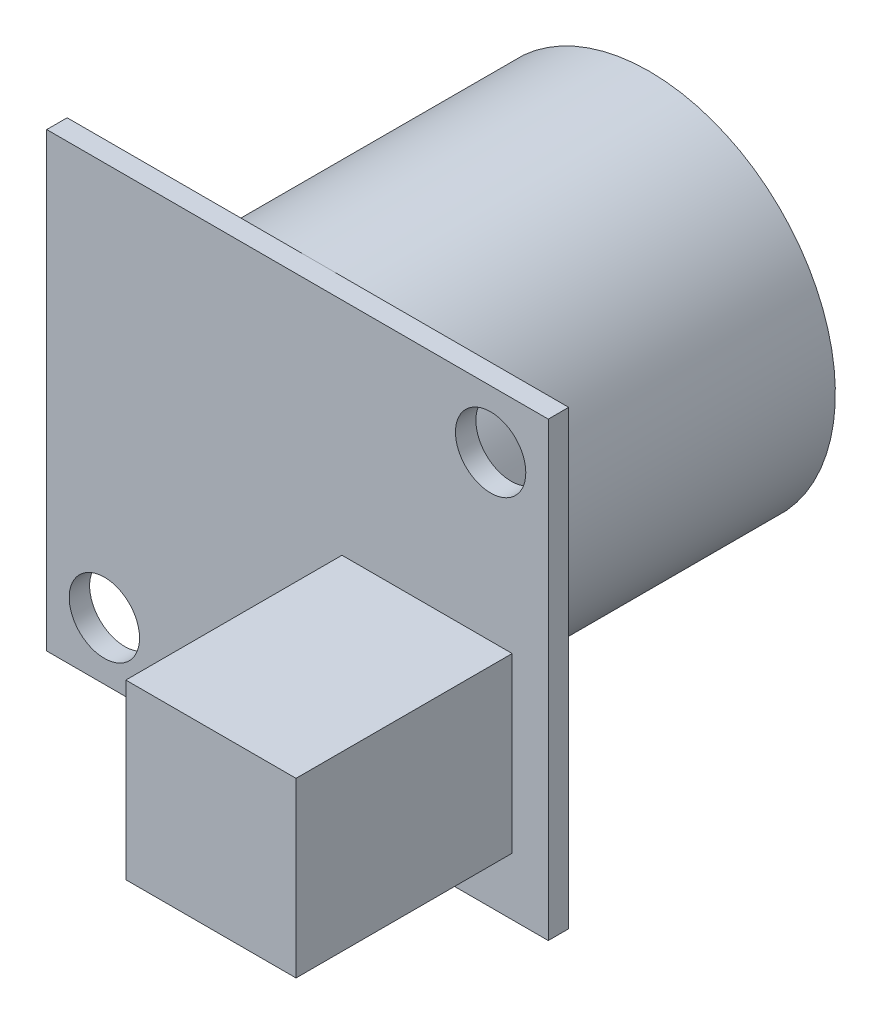
ISO-10303-21;
HEADER;
FILE_DESCRIPTION(('STEP AP214'),'2;1');
FILE_NAME('part.step','',(''),(''),'','','');
FILE_SCHEMA(('AUTOMOTIVE_DESIGN { 1 0 10303 214 1 1 1 1 }'));
ENDSEC;
DATA;
#1=APPLICATION_CONTEXT('core data for automotive mechanical design processes');
#2=APPLICATION_PROTOCOL_DEFINITION('international standard','automotive_design',2000,#1);
#3=PRODUCT_CONTEXT('',#1,'mechanical');
#4=PRODUCT('Part','Part','',(#3));
#5=PRODUCT_RELATED_PRODUCT_CATEGORY('part','',(#4));
#6=PRODUCT_DEFINITION_FORMATION('','',#4);
#7=PRODUCT_DEFINITION_CONTEXT('part definition',#1,'design');
#8=PRODUCT_DEFINITION('design','',#6,#7);
#9=PRODUCT_DEFINITION_SHAPE('','',#8);
#10=(LENGTH_UNIT() NAMED_UNIT(*) SI_UNIT(.MILLI.,.METRE.));
#11=(NAMED_UNIT(*) PLANE_ANGLE_UNIT() SI_UNIT($,.RADIAN.));
#12=(NAMED_UNIT(*) SI_UNIT($,.STERADIAN.) SOLID_ANGLE_UNIT());
#13=UNCERTAINTY_MEASURE_WITH_UNIT(LENGTH_MEASURE(1.E-05),#10,'distance_accuracy_value','');
#14=(GEOMETRIC_REPRESENTATION_CONTEXT(3) GLOBAL_UNCERTAINTY_ASSIGNED_CONTEXT((#13)) GLOBAL_UNIT_ASSIGNED_CONTEXT((#10,
#11,#12)) REPRESENTATION_CONTEXT('',''));
#15=CARTESIAN_POINT('',(0.,0.,0.));
#16=DIRECTION('',(0.,0.,1.));
#17=DIRECTION('',(1.,0.,0.));
#18=AXIS2_PLACEMENT_3D('',#15,#16,#17);
#19=CARTESIAN_POINT('',(0.,0.,0.9));
#20=DIRECTION('',(0.,0.,1.));
#21=DIRECTION('',(1.,0.,0.));
#22=AXIS2_PLACEMENT_3D('',#19,#20,#21);
#23=PLANE('',#22);
#24=CARTESIAN_POINT('',(8.51000000000001,7.41,0.9));
#25=DIRECTION('',(0.,0.,1.));
#26=DIRECTION('',(1.,0.,0.));
#27=AXIS2_PLACEMENT_3D('',#24,#25,#26);
#28=CIRCLE('',#27,1.55);
#29=CARTESIAN_POINT('',(10.06,7.41,0.9));
#30=VERTEX_POINT('',#29);
#31=EDGE_CURVE('E179',#30,#30,#28,.T.);
#32=ORIENTED_EDGE('',*,*,#31,.F.);
#33=EDGE_LOOP('',(#32));
#34=FACE_BOUND('',#33,.T.);
#35=DIRECTION('',(1.,0.,0.));
#36=VECTOR('',#35,1.);
#37=CARTESIAN_POINT('',(-11.05,-9.95,0.9));
#38=LINE('',#37,#36);
#39=CARTESIAN_POINT('',(-11.05,-9.95,0.9));
#40=VERTEX_POINT('',#39);
#41=CARTESIAN_POINT('',(11.05,-9.95,0.9));
#42=VERTEX_POINT('',#41);
#43=EDGE_CURVE('E165',#40,#42,#38,.T.);
#44=ORIENTED_EDGE('',*,*,#43,.T.);
#45=DIRECTION('',(0.,1.,0.));
#46=VECTOR('',#45,1.);
#47=CARTESIAN_POINT('',(11.05,-9.95,0.9));
#48=LINE('',#47,#46);
#49=CARTESIAN_POINT('',(11.05,9.95,0.9));
#50=VERTEX_POINT('',#49);
#51=EDGE_CURVE('E117',#42,#50,#48,.T.);
#52=ORIENTED_EDGE('',*,*,#51,.T.);
#53=DIRECTION('',(1.,0.,0.));
#54=VECTOR('',#53,1.);
#55=CARTESIAN_POINT('',(-11.05,9.95,0.9));
#56=LINE('',#55,#54);
#57=CARTESIAN_POINT('',(-11.05,9.95,0.9));
#58=VERTEX_POINT('',#57);
#59=EDGE_CURVE('E172',#58,#50,#56,.T.);
#60=ORIENTED_EDGE('',*,*,#59,.F.);
#61=DIRECTION('',(0.,1.,0.));
#62=VECTOR('',#61,1.);
#63=CARTESIAN_POINT('',(-11.05,-9.95,0.9));
#64=LINE('',#63,#62);
#65=EDGE_CURVE('E168',#40,#58,#64,.T.);
#66=ORIENTED_EDGE('',*,*,#65,.F.);
#67=EDGE_LOOP('',(#44,#52,#60,#66));
#68=FACE_BOUND('',#67,.T.);
#69=CARTESIAN_POINT('',(-8.50999999999999,-7.41,0.9));
#70=DIRECTION('',(0.,0.,1.));
#71=DIRECTION('',(1.,0.,0.));
#72=AXIS2_PLACEMENT_3D('',#69,#70,#71);
#73=CIRCLE('',#72,1.55);
#74=CARTESIAN_POINT('',(-6.96,-7.41,0.9));
#75=VERTEX_POINT('',#74);
#76=EDGE_CURVE('E187',#75,#75,#73,.T.);
#77=ORIENTED_EDGE('',*,*,#76,.F.);
#78=EDGE_LOOP('',(#77));
#79=FACE_BOUND('',#78,.T.);
#80=DIRECTION('',(1.,0.,0.));
#81=VECTOR('',#80,1.);
#82=CARTESIAN_POINT('',(1.96017418056904,-7.41,0.9));
#83=LINE('',#82,#81);
#84=CARTESIAN_POINT('',(1.96017418056904,-7.41,0.9));
#85=VERTEX_POINT('',#84);
#86=CARTESIAN_POINT('',(9.46017418056904,-7.41,0.9));
#87=VERTEX_POINT('',#86);
#88=EDGE_CURVE('E246',#85,#87,#83,.T.);
#89=ORIENTED_EDGE('',*,*,#88,.F.);
#90=DIRECTION('',(0.,-1.,0.));
#91=VECTOR('',#90,1.);
#92=CARTESIAN_POINT('',(1.96017418056904,0.210000000000003,0.9));
#93=LINE('',#92,#91);
#94=CARTESIAN_POINT('',(1.96017418056904,0.210000000000003,0.9));
#95=VERTEX_POINT('',#94);
#96=EDGE_CURVE('E248',#95,#85,#93,.T.);
#97=ORIENTED_EDGE('',*,*,#96,.F.);
#98=DIRECTION('',(-1.,0.,0.));
#99=VECTOR('',#98,1.);
#100=CARTESIAN_POINT('',(1.96017418056904,0.210000000000003,0.9));
#101=LINE('',#100,#99);
#102=CARTESIAN_POINT('',(9.46017418056904,0.210000000000003,0.9));
#103=VERTEX_POINT('',#102);
#104=EDGE_CURVE('E241',#103,#95,#101,.T.);
#105=ORIENTED_EDGE('',*,*,#104,.F.);
#106=DIRECTION('',(0.,1.,0.));
#107=VECTOR('',#106,1.);
#108=CARTESIAN_POINT('',(9.46017418056904,0.210000000000003,0.9));
#109=LINE('',#108,#107);
#110=EDGE_CURVE('E244',#87,#103,#109,.T.);
#111=ORIENTED_EDGE('',*,*,#110,.F.);
#112=EDGE_LOOP('',(#89,#97,#105,#111));
#113=FACE_BOUND('',#112,.T.);
#114=ADVANCED_FACE('F67',(#34,#68,#79,#113),#23,.T.);
#115=CARTESIAN_POINT('',(0.,0.,0.));
#116=DIRECTION('',(0.,0.,1.));
#117=DIRECTION('',(1.,0.,0.));
#118=AXIS2_PLACEMENT_3D('',#115,#116,#117);
#119=PLANE('',#118);
#120=DIRECTION('',(1.,0.,0.));
#121=VECTOR('',#120,1.);
#122=CARTESIAN_POINT('',(-11.05,9.95,0.));
#123=LINE('',#122,#121);
#124=CARTESIAN_POINT('',(-11.05,9.95,0.));
#125=VERTEX_POINT('',#124);
#126=CARTESIAN_POINT('',(0.,9.95,0.));
#127=VERTEX_POINT('',#126);
#128=EDGE_CURVE('E145',#125,#127,#123,.T.);
#129=ORIENTED_EDGE('',*,*,#128,.T.);
#130=CARTESIAN_POINT('',(0.,1.75,0.));
#131=DIRECTION('',(0.,0.,-1.));
#132=DIRECTION('',(-1.,0.,0.));
#133=AXIS2_PLACEMENT_3D('',#130,#131,#132);
#134=CIRCLE('',#133,8.2);
#135=EDGE_CURVE('E150',#127,#127,#134,.T.);
#136=ORIENTED_EDGE('',*,*,#135,.F.);
#137=CARTESIAN_POINT('',(11.05,9.95,0.));
#138=VERTEX_POINT('',#137);
#139=EDGE_CURVE('E153',#127,#138,#123,.T.);
#140=ORIENTED_EDGE('',*,*,#139,.T.);
#141=DIRECTION('',(0.,1.,0.));
#142=VECTOR('',#141,1.);
#143=CARTESIAN_POINT('',(11.05,-9.95,0.));
#144=LINE('',#143,#142);
#145=CARTESIAN_POINT('',(11.05,-9.95,0.));
#146=VERTEX_POINT('',#145);
#147=EDGE_CURVE('E159',#146,#138,#144,.T.);
#148=ORIENTED_EDGE('',*,*,#147,.F.);
#149=DIRECTION('',(1.,0.,0.));
#150=VECTOR('',#149,1.);
#151=CARTESIAN_POINT('',(-11.05,-9.95,0.));
#152=LINE('',#151,#150);
#153=CARTESIAN_POINT('',(-11.05,-9.95,0.));
#154=VERTEX_POINT('',#153);
#155=EDGE_CURVE('E160',#154,#146,#152,.T.);
#156=ORIENTED_EDGE('',*,*,#155,.F.);
#157=DIRECTION('',(0.,1.,0.));
#158=VECTOR('',#157,1.);
#159=CARTESIAN_POINT('',(-11.05,-9.95,0.));
#160=LINE('',#159,#158);
#161=EDGE_CURVE('E151',#154,#125,#160,.T.);
#162=ORIENTED_EDGE('',*,*,#161,.T.);
#163=EDGE_LOOP('',(#129,#136,#140,#148,#156,#162));
#164=FACE_BOUND('',#163,.T.);
#165=CARTESIAN_POINT('',(8.51000000000001,7.41,0.));
#166=DIRECTION('',(0.,0.,1.));
#167=DIRECTION('',(1.,0.,0.));
#168=AXIS2_PLACEMENT_3D('',#165,#166,#167);
#169=CIRCLE('',#168,1.55);
#170=CARTESIAN_POINT('',(10.06,7.41,0.));
#171=VERTEX_POINT('',#170);
#172=EDGE_CURVE('E182',#171,#171,#169,.T.);
#173=ORIENTED_EDGE('',*,*,#172,.T.);
#174=EDGE_LOOP('',(#173));
#175=FACE_BOUND('',#174,.T.);
#176=CARTESIAN_POINT('',(-8.50999999999999,-7.41,0.));
#177=DIRECTION('',(0.,0.,1.));
#178=DIRECTION('',(1.,0.,0.));
#179=AXIS2_PLACEMENT_3D('',#176,#177,#178);
#180=CIRCLE('',#179,1.55);
#181=CARTESIAN_POINT('',(-6.96,-7.41,0.));
#182=VERTEX_POINT('',#181);
#183=EDGE_CURVE('E190',#182,#182,#180,.T.);
#184=ORIENTED_EDGE('',*,*,#183,.T.);
#185=EDGE_LOOP('',(#184));
#186=FACE_BOUND('',#185,.T.);
#187=ADVANCED_FACE('F147',(#164,#175,#186),#119,.F.);
#188=CARTESIAN_POINT('',(-11.05,-9.95,0.9));
#189=DIRECTION('',(0.,1.,0.));
#190=DIRECTION('',(0.,0.,1.));
#191=AXIS2_PLACEMENT_3D('',#188,#189,#190);
#192=PLANE('',#191);
#193=ORIENTED_EDGE('',*,*,#155,.T.);
#194=DIRECTION('',(0.,0.,-1.));
#195=VECTOR('',#194,1.);
#196=CARTESIAN_POINT('',(11.05,-9.95,0.9));
#197=LINE('',#196,#195);
#198=EDGE_CURVE('E12',#42,#146,#197,.T.);
#199=ORIENTED_EDGE('',*,*,#198,.F.);
#200=ORIENTED_EDGE('',*,*,#43,.F.);
#201=DIRECTION('',(0.,0.,-1.));
#202=VECTOR('',#201,1.);
#203=CARTESIAN_POINT('',(-11.05,-9.95,0.9));
#204=LINE('',#203,#202);
#205=EDGE_CURVE('E91',#40,#154,#204,.T.);
#206=ORIENTED_EDGE('',*,*,#205,.T.);
#207=EDGE_LOOP('',(#193,#199,#200,#206));
#208=FACE_BOUND('',#207,.T.);
#209=ADVANCED_FACE('F69',(#208),#192,.F.);
#210=CARTESIAN_POINT('',(11.05,-9.95,0.9));
#211=DIRECTION('',(-1.,0.,0.));
#212=DIRECTION('',(0.,0.,1.));
#213=AXIS2_PLACEMENT_3D('',#210,#211,#212);
#214=PLANE('',#213);
#215=ORIENTED_EDGE('',*,*,#147,.T.);
#216=DIRECTION('',(0.,0.,-1.));
#217=VECTOR('',#216,1.);
#218=CARTESIAN_POINT('',(11.05,9.95,0.9));
#219=LINE('',#218,#217);
#220=EDGE_CURVE('E75',#50,#138,#219,.T.);
#221=ORIENTED_EDGE('',*,*,#220,.F.);
#222=ORIENTED_EDGE('',*,*,#51,.F.);
#223=ORIENTED_EDGE('',*,*,#198,.T.);
#224=EDGE_LOOP('',(#215,#221,#222,#223));
#225=FACE_BOUND('',#224,.T.);
#226=ADVANCED_FACE('F192',(#225),#214,.F.);
#227=CARTESIAN_POINT('',(-11.05,9.95,0.9));
#228=DIRECTION('',(0.,1.,0.));
#229=DIRECTION('',(0.,0.,1.));
#230=AXIS2_PLACEMENT_3D('',#227,#228,#229);
#231=PLANE('',#230);
#232=ORIENTED_EDGE('',*,*,#128,.F.);
#233=DIRECTION('',(0.,0.,-1.));
#234=VECTOR('',#233,1.);
#235=CARTESIAN_POINT('',(-11.05,9.95,0.9));
#236=LINE('',#235,#234);
#237=EDGE_CURVE('E167',#58,#125,#236,.T.);
#238=ORIENTED_EDGE('',*,*,#237,.F.);
#239=ORIENTED_EDGE('',*,*,#59,.T.);
#240=ORIENTED_EDGE('',*,*,#220,.T.);
#241=ORIENTED_EDGE('',*,*,#139,.F.);
#242=EDGE_LOOP('',(#232,#238,#239,#240,#241));
#243=FACE_BOUND('',#242,.T.);
#244=ADVANCED_FACE('F156',(#243),#231,.T.);
#245=CARTESIAN_POINT('',(-11.05,-9.95,0.9));
#246=DIRECTION('',(-1.,0.,0.));
#247=DIRECTION('',(0.,0.,1.));
#248=AXIS2_PLACEMENT_3D('',#245,#246,#247);
#249=PLANE('',#248);
#250=ORIENTED_EDGE('',*,*,#161,.F.);
#251=ORIENTED_EDGE('',*,*,#205,.F.);
#252=ORIENTED_EDGE('',*,*,#65,.T.);
#253=ORIENTED_EDGE('',*,*,#237,.T.);
#254=EDGE_LOOP('',(#250,#251,#252,#253));
#255=FACE_BOUND('',#254,.T.);
#256=ADVANCED_FACE('F169',(#255),#249,.T.);
#257=CARTESIAN_POINT('',(8.51000000000001,7.41,0.9));
#258=DIRECTION('',(0.,0.,-1.));
#259=DIRECTION('',(-1.,0.,0.));
#260=AXIS2_PLACEMENT_3D('',#257,#258,#259);
#261=CYLINDRICAL_SURFACE('',#260,1.55);
#262=ORIENTED_EDGE('',*,*,#31,.T.);
#263=EDGE_LOOP('',(#262));
#264=FACE_BOUND('',#263,.T.);
#265=ORIENTED_EDGE('',*,*,#172,.F.);
#266=EDGE_LOOP('',(#265));
#267=FACE_BOUND('',#266,.T.);
#268=ADVANCED_FACE('F207',(#264,#267),#261,.F.);
#269=CARTESIAN_POINT('',(-8.50999999999999,-7.41,0.9));
#270=DIRECTION('',(0.,0.,-1.));
#271=DIRECTION('',(-1.,0.,0.));
#272=AXIS2_PLACEMENT_3D('',#269,#270,#271);
#273=CYLINDRICAL_SURFACE('',#272,1.55);
#274=ORIENTED_EDGE('',*,*,#76,.T.);
#275=EDGE_LOOP('',(#274));
#276=FACE_BOUND('',#275,.T.);
#277=ORIENTED_EDGE('',*,*,#183,.F.);
#278=EDGE_LOOP('',(#277));
#279=FACE_BOUND('',#278,.T.);
#280=ADVANCED_FACE('F214',(#276,#279),#273,.F.);
#281=CARTESIAN_POINT('',(1.96017418056904,0.210000000000003,10.425));
#282=DIRECTION('',(1.,0.,0.));
#283=DIRECTION('',(0.,1.,0.));
#284=AXIS2_PLACEMENT_3D('',#281,#282,#283);
#285=PLANE('',#284);
#286=ORIENTED_EDGE('',*,*,#96,.T.);
#287=DIRECTION('',(0.,0.,-1.));
#288=VECTOR('',#287,1.);
#289=CARTESIAN_POINT('',(1.96017418056904,-7.41,10.425));
#290=LINE('',#289,#288);
#291=CARTESIAN_POINT('',(1.96017418056904,-7.41,10.425));
#292=VERTEX_POINT('',#291);
#293=EDGE_CURVE('E226',#292,#85,#290,.T.);
#294=ORIENTED_EDGE('',*,*,#293,.F.);
#295=DIRECTION('',(0.,-1.,0.));
#296=VECTOR('',#295,1.);
#297=CARTESIAN_POINT('',(1.96017418056904,0.210000000000003,10.425));
#298=LINE('',#297,#296);
#299=CARTESIAN_POINT('',(1.96017418056904,0.210000000000003,10.425));
#300=VERTEX_POINT('',#299);
#301=EDGE_CURVE('E243',#300,#292,#298,.T.);
#302=ORIENTED_EDGE('',*,*,#301,.F.);
#303=DIRECTION('',(0.,0.,-1.));
#304=VECTOR('',#303,1.);
#305=CARTESIAN_POINT('',(1.96017418056904,0.210000000000003,10.425));
#306=LINE('',#305,#304);
#307=EDGE_CURVE('E237',#300,#95,#306,.T.);
#308=ORIENTED_EDGE('',*,*,#307,.T.);
#309=EDGE_LOOP('',(#286,#294,#302,#308));
#310=FACE_BOUND('',#309,.T.);
#311=ADVANCED_FACE('F218',(#310),#285,.F.);
#312=CARTESIAN_POINT('',(1.96017418056904,-7.41,10.425));
#313=DIRECTION('',(0.,1.,0.));
#314=DIRECTION('',(0.,0.,1.));
#315=AXIS2_PLACEMENT_3D('',#312,#313,#314);
#316=PLANE('',#315);
#317=ORIENTED_EDGE('',*,*,#88,.T.);
#318=DIRECTION('',(0.,0.,-1.));
#319=VECTOR('',#318,1.);
#320=CARTESIAN_POINT('',(9.46017418056904,-7.41,10.425));
#321=LINE('',#320,#319);
#322=CARTESIAN_POINT('',(9.46017418056904,-7.41,10.425));
#323=VERTEX_POINT('',#322);
#324=EDGE_CURVE('E228',#323,#87,#321,.T.);
#325=ORIENTED_EDGE('',*,*,#324,.F.);
#326=DIRECTION('',(1.,0.,0.));
#327=VECTOR('',#326,1.);
#328=CARTESIAN_POINT('',(1.96017418056904,-7.41,10.425));
#329=LINE('',#328,#327);
#330=EDGE_CURVE('E254',#292,#323,#329,.T.);
#331=ORIENTED_EDGE('',*,*,#330,.F.);
#332=ORIENTED_EDGE('',*,*,#293,.T.);
#333=EDGE_LOOP('',(#317,#325,#331,#332));
#334=FACE_BOUND('',#333,.T.);
#335=ADVANCED_FACE('F283',(#334),#316,.F.);
#336=CARTESIAN_POINT('',(9.46017418056904,0.210000000000003,10.425));
#337=DIRECTION('',(-1.,0.,0.));
#338=DIRECTION('',(0.,-1.,0.));
#339=AXIS2_PLACEMENT_3D('',#336,#337,#338);
#340=PLANE('',#339);
#341=ORIENTED_EDGE('',*,*,#110,.T.);
#342=DIRECTION('',(0.,0.,-1.));
#343=VECTOR('',#342,1.);
#344=CARTESIAN_POINT('',(9.46017418056904,0.210000000000003,10.425));
#345=LINE('',#344,#343);
#346=CARTESIAN_POINT('',(9.46017418056904,0.210000000000003,10.425));
#347=VERTEX_POINT('',#346);
#348=EDGE_CURVE('E82',#347,#103,#345,.T.);
#349=ORIENTED_EDGE('',*,*,#348,.F.);
#350=DIRECTION('',(0.,1.,0.));
#351=VECTOR('',#350,1.);
#352=CARTESIAN_POINT('',(9.46017418056904,0.210000000000003,10.425));
#353=LINE('',#352,#351);
#354=EDGE_CURVE('E252',#323,#347,#353,.T.);
#355=ORIENTED_EDGE('',*,*,#354,.F.);
#356=ORIENTED_EDGE('',*,*,#324,.T.);
#357=EDGE_LOOP('',(#341,#349,#355,#356));
#358=FACE_BOUND('',#357,.T.);
#359=ADVANCED_FACE('F280',(#358),#340,.F.);
#360=CARTESIAN_POINT('',(1.96017418056904,0.210000000000003,10.425));
#361=DIRECTION('',(0.,-1.,0.));
#362=DIRECTION('',(0.,0.,-1.));
#363=AXIS2_PLACEMENT_3D('',#360,#361,#362);
#364=PLANE('',#363);
#365=ORIENTED_EDGE('',*,*,#104,.T.);
#366=ORIENTED_EDGE('',*,*,#307,.F.);
#367=DIRECTION('',(-1.,0.,0.));
#368=VECTOR('',#367,1.);
#369=CARTESIAN_POINT('',(1.96017418056904,0.210000000000003,10.425));
#370=LINE('',#369,#368);
#371=EDGE_CURVE('E240',#347,#300,#370,.T.);
#372=ORIENTED_EDGE('',*,*,#371,.F.);
#373=ORIENTED_EDGE('',*,*,#348,.T.);
#374=EDGE_LOOP('',(#365,#366,#372,#373));
#375=FACE_BOUND('',#374,.T.);
#376=ADVANCED_FACE('F274',(#375),#364,.F.);
#377=CARTESIAN_POINT('',(0.,0.,10.425));
#378=DIRECTION('',(0.,0.,1.));
#379=DIRECTION('',(1.,0.,0.));
#380=AXIS2_PLACEMENT_3D('',#377,#378,#379);
#381=PLANE('',#380);
#382=ORIENTED_EDGE('',*,*,#301,.T.);
#383=ORIENTED_EDGE('',*,*,#330,.T.);
#384=ORIENTED_EDGE('',*,*,#354,.T.);
#385=ORIENTED_EDGE('',*,*,#371,.T.);
#386=EDGE_LOOP('',(#382,#383,#384,#385));
#387=FACE_BOUND('',#386,.T.);
#388=ADVANCED_FACE('F267',(#387),#381,.T.);
#389=CARTESIAN_POINT('',(0.,1.75,-14.6));
#390=DIRECTION('',(0.,0.,1.));
#391=DIRECTION('',(1.,0.,0.));
#392=AXIS2_PLACEMENT_3D('',#389,#390,#391);
#393=CYLINDRICAL_SURFACE('',#392,8.2);
#394=CARTESIAN_POINT('',(0.,1.75,-14.6));
#395=DIRECTION('',(0.,0.,-1.));
#396=DIRECTION('',(-1.,0.,0.));
#397=AXIS2_PLACEMENT_3D('',#394,#395,#396);
#398=CIRCLE('',#397,8.2);
#399=CARTESIAN_POINT('',(-8.19999999999999,1.75,-14.6));
#400=VERTEX_POINT('',#399);
#401=EDGE_CURVE('E250',#400,#400,#398,.T.);
#402=ORIENTED_EDGE('',*,*,#401,.F.);
#403=EDGE_LOOP('',(#402));
#404=FACE_BOUND('',#403,.T.);
#405=ORIENTED_EDGE('',*,*,#135,.T.);
#406=EDGE_LOOP('',(#405));
#407=FACE_BOUND('',#406,.T.);
#408=ADVANCED_FACE('F264',(#404,#407),#393,.T.);
#409=CARTESIAN_POINT('',(0.,1.75,-14.6));
#410=DIRECTION('',(0.,0.,-1.));
#411=DIRECTION('',(-1.,0.,0.));
#412=AXIS2_PLACEMENT_3D('',#409,#410,#411);
#413=PLANE('',#412);
#414=ORIENTED_EDGE('',*,*,#401,.T.);
#415=EDGE_LOOP('',(#414));
#416=FACE_BOUND('',#415,.T.);
#417=ADVANCED_FACE('F262',(#416),#413,.T.);
#418=CLOSED_SHELL('',(#114,#187,#209,#226,#244,#256,#268,#280,#311,#335,#359,#376,#388,#408,#417));
#419=MANIFOLD_SOLID_BREP('B2',#418);
#420=ADVANCED_BREP_SHAPE_REPRESENTATION('',(#18,#419),#14);
#421=SHAPE_DEFINITION_REPRESENTATION(#9,#420);
ENDSEC;
END-ISO-10303-21;
